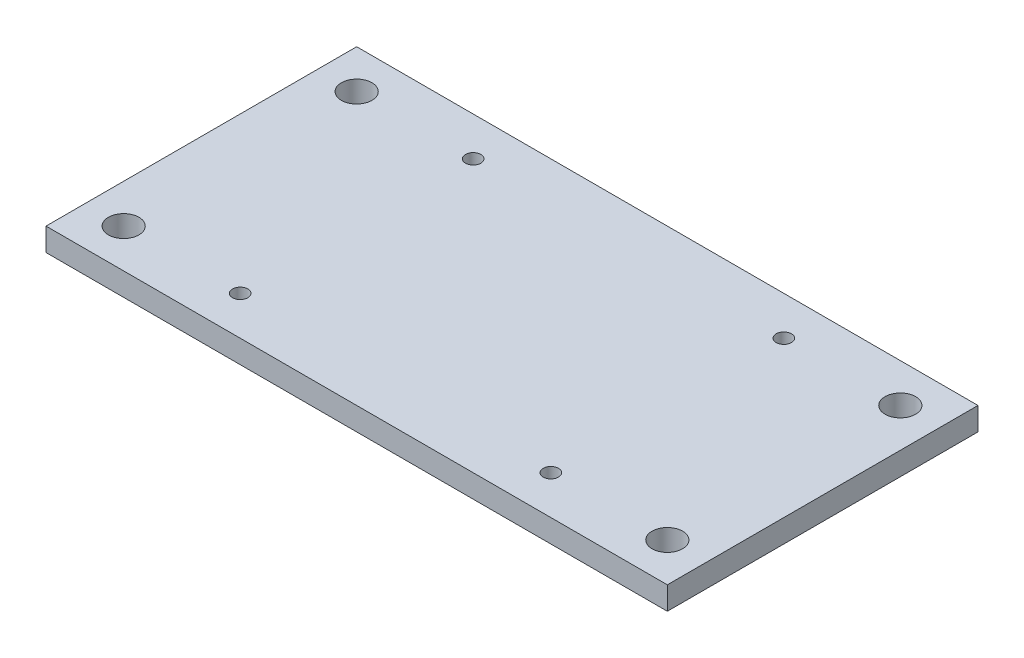
ISO-10303-21;
HEADER;
FILE_DESCRIPTION(('STEP AP214'),'2;1');
FILE_NAME('part.step','',(''),(''),'','','');
FILE_SCHEMA(('AUTOMOTIVE_DESIGN { 1 0 10303 214 1 1 1 1 }'));
ENDSEC;
DATA;
#1=APPLICATION_CONTEXT('core data for automotive mechanical design processes');
#2=APPLICATION_PROTOCOL_DEFINITION('international standard','automotive_design',2000,#1);
#3=PRODUCT_CONTEXT('',#1,'mechanical');
#4=PRODUCT('Part','Part','',(#3));
#5=PRODUCT_RELATED_PRODUCT_CATEGORY('part','',(#4));
#6=PRODUCT_DEFINITION_FORMATION('','',#4);
#7=PRODUCT_DEFINITION_CONTEXT('part definition',#1,'design');
#8=PRODUCT_DEFINITION('design','',#6,#7);
#9=PRODUCT_DEFINITION_SHAPE('','',#8);
#10=(LENGTH_UNIT() NAMED_UNIT(*) SI_UNIT(.MILLI.,.METRE.));
#11=(NAMED_UNIT(*) PLANE_ANGLE_UNIT() SI_UNIT($,.RADIAN.));
#12=(NAMED_UNIT(*) SI_UNIT($,.STERADIAN.) SOLID_ANGLE_UNIT());
#13=UNCERTAINTY_MEASURE_WITH_UNIT(LENGTH_MEASURE(1.E-05),#10,'distance_accuracy_value','');
#14=(GEOMETRIC_REPRESENTATION_CONTEXT(3) GLOBAL_UNCERTAINTY_ASSIGNED_CONTEXT((#13)) GLOBAL_UNIT_ASSIGNED_CONTEXT((#10,
#11,#12)) REPRESENTATION_CONTEXT('',''));
#15=CARTESIAN_POINT('',(0.,0.,0.));
#16=DIRECTION('',(0.,0.,1.));
#17=DIRECTION('',(1.,0.,0.));
#18=AXIS2_PLACEMENT_3D('',#15,#16,#17);
#19=CARTESIAN_POINT('',(0.,1.5,0.));
#20=DIRECTION('',(0.,-1.,0.));
#21=DIRECTION('',(0.,0.,-1.));
#22=AXIS2_PLACEMENT_3D('',#19,#20,#21);
#23=PLANE('',#22);
#24=CARTESIAN_POINT('',(30.48,1.5,-2.54));
#25=DIRECTION('',(0.,1.,0.));
#26=DIRECTION('',(0.,0.,-1.));
#27=AXIS2_PLACEMENT_3D('',#24,#25,#26);
#28=CIRCLE('',#27,0.499999999999999);
#29=CARTESIAN_POINT('',(30.48,1.5,-3.04));
#30=VERTEX_POINT('',#29);
#31=EDGE_CURVE('E145',#30,#30,#28,.T.);
#32=ORIENTED_EDGE('',*,*,#31,.F.);
#33=EDGE_LOOP('',(#32));
#34=FACE_BOUND('',#33,.T.);
#35=CARTESIAN_POINT('',(10.16,1.5,-2.54));
#36=DIRECTION('',(0.,1.,0.));
#37=DIRECTION('',(0.,0.,1.));
#38=AXIS2_PLACEMENT_3D('',#35,#36,#37);
#39=CIRCLE('',#38,0.499999999999999);
#40=CARTESIAN_POINT('',(10.16,1.5,-2.04));
#41=VERTEX_POINT('',#40);
#42=EDGE_CURVE('E133',#41,#41,#39,.T.);
#43=ORIENTED_EDGE('',*,*,#42,.F.);
#44=EDGE_LOOP('',(#43));
#45=FACE_BOUND('',#44,.T.);
#46=CARTESIAN_POINT('',(38.1,1.5,-17.78));
#47=DIRECTION('',(0.,1.,0.));
#48=DIRECTION('',(0.,0.,1.));
#49=AXIS2_PLACEMENT_3D('',#46,#47,#48);
#50=CIRCLE('',#49,0.999999999999991);
#51=CARTESIAN_POINT('',(38.1,1.5,-16.78));
#52=VERTEX_POINT('',#51);
#53=EDGE_CURVE('E121',#52,#52,#50,.T.);
#54=ORIENTED_EDGE('',*,*,#53,.F.);
#55=EDGE_LOOP('',(#54));
#56=FACE_BOUND('',#55,.T.);
#57=CARTESIAN_POINT('',(2.54,1.5,-2.54));
#58=DIRECTION('',(0.,1.,0.));
#59=DIRECTION('',(0.,0.,1.));
#60=AXIS2_PLACEMENT_3D('',#57,#58,#59);
#61=CIRCLE('',#60,1.);
#62=CARTESIAN_POINT('',(2.54,1.5,-1.54));
#63=VERTEX_POINT('',#62);
#64=EDGE_CURVE('E100',#63,#63,#61,.T.);
#65=ORIENTED_EDGE('',*,*,#64,.F.);
#66=EDGE_LOOP('',(#65));
#67=FACE_BOUND('',#66,.T.);
#68=DIRECTION('',(0.,0.,1.));
#69=VECTOR('',#68,1.);
#70=CARTESIAN_POINT('',(0.,1.5,0.));
#71=LINE('',#70,#69);
#72=CARTESIAN_POINT('',(0.,1.5,-20.32));
#73=VERTEX_POINT('',#72);
#74=CARTESIAN_POINT('',(0.,1.5,0.));
#75=VERTEX_POINT('',#74);
#76=EDGE_CURVE('E85',#73,#75,#71,.T.);
#77=ORIENTED_EDGE('',*,*,#76,.T.);
#78=DIRECTION('',(1.,0.,0.));
#79=VECTOR('',#78,1.);
#80=CARTESIAN_POINT('',(0.,1.5,0.));
#81=LINE('',#80,#79);
#82=CARTESIAN_POINT('',(40.64,1.5,0.));
#83=VERTEX_POINT('',#82);
#84=EDGE_CURVE('E80',#75,#83,#81,.T.);
#85=ORIENTED_EDGE('',*,*,#84,.T.);
#86=DIRECTION('',(0.,0.,-1.));
#87=VECTOR('',#86,1.);
#88=CARTESIAN_POINT('',(40.64,1.5,0.));
#89=LINE('',#88,#87);
#90=CARTESIAN_POINT('',(40.64,1.5,-20.32));
#91=VERTEX_POINT('',#90);
#92=EDGE_CURVE('E83',#83,#91,#89,.T.);
#93=ORIENTED_EDGE('',*,*,#92,.T.);
#94=DIRECTION('',(-1.,0.,0.));
#95=VECTOR('',#94,1.);
#96=CARTESIAN_POINT('',(0.,1.5,-20.32));
#97=LINE('',#96,#95);
#98=EDGE_CURVE('E50',#91,#73,#97,.T.);
#99=ORIENTED_EDGE('',*,*,#98,.T.);
#100=EDGE_LOOP('',(#77,#85,#93,#99));
#101=FACE_BOUND('',#100,.T.);
#102=CARTESIAN_POINT('',(38.1,1.5,-2.54));
#103=DIRECTION('',(0.,1.,0.));
#104=DIRECTION('',(0.,0.,-1.));
#105=AXIS2_PLACEMENT_3D('',#102,#103,#104);
#106=CIRCLE('',#105,0.999999999999998);
#107=CARTESIAN_POINT('',(38.1,1.5,-3.54));
#108=VERTEX_POINT('',#107);
#109=EDGE_CURVE('E115',#108,#108,#106,.T.);
#110=ORIENTED_EDGE('',*,*,#109,.F.);
#111=EDGE_LOOP('',(#110));
#112=FACE_BOUND('',#111,.T.);
#113=CARTESIAN_POINT('',(2.54,1.5,-17.78));
#114=DIRECTION('',(0.,1.,0.));
#115=DIRECTION('',(0.,0.,-1.));
#116=AXIS2_PLACEMENT_3D('',#113,#114,#115);
#117=CIRCLE('',#116,0.999999999999999);
#118=CARTESIAN_POINT('',(2.54,1.5,-18.78));
#119=VERTEX_POINT('',#118);
#120=EDGE_CURVE('E127',#119,#119,#117,.T.);
#121=ORIENTED_EDGE('',*,*,#120,.F.);
#122=EDGE_LOOP('',(#121));
#123=FACE_BOUND('',#122,.T.);
#124=CARTESIAN_POINT('',(10.16,1.5,-17.78));
#125=DIRECTION('',(0.,1.,0.));
#126=DIRECTION('',(0.,0.,-1.));
#127=AXIS2_PLACEMENT_3D('',#124,#125,#126);
#128=CIRCLE('',#127,0.499999999999999);
#129=CARTESIAN_POINT('',(10.16,1.5,-18.28));
#130=VERTEX_POINT('',#129);
#131=EDGE_CURVE('E139',#130,#130,#128,.T.);
#132=ORIENTED_EDGE('',*,*,#131,.F.);
#133=EDGE_LOOP('',(#132));
#134=FACE_BOUND('',#133,.T.);
#135=CARTESIAN_POINT('',(30.48,1.5,-17.78));
#136=DIRECTION('',(0.,1.,0.));
#137=DIRECTION('',(0.,0.,1.));
#138=AXIS2_PLACEMENT_3D('',#135,#136,#137);
#139=CIRCLE('',#138,0.499999999999999);
#140=CARTESIAN_POINT('',(30.48,1.5,-17.28));
#141=VERTEX_POINT('',#140);
#142=EDGE_CURVE('E151',#141,#141,#139,.T.);
#143=ORIENTED_EDGE('',*,*,#142,.F.);
#144=EDGE_LOOP('',(#143));
#145=FACE_BOUND('',#144,.T.);
#146=ADVANCED_FACE('F33',(#34,#45,#56,#67,#101,#112,#123,#134,#145),#23,.F.);
#147=CARTESIAN_POINT('',(0.,0.,0.));
#148=DIRECTION('',(0.,-1.,0.));
#149=DIRECTION('',(0.,0.,-1.));
#150=AXIS2_PLACEMENT_3D('',#147,#148,#149);
#151=PLANE('',#150);
#152=CARTESIAN_POINT('',(30.48,0.,-2.54));
#153=DIRECTION('',(0.,1.,0.));
#154=DIRECTION('',(0.,0.,-1.));
#155=AXIS2_PLACEMENT_3D('',#152,#153,#154);
#156=CIRCLE('',#155,0.499999999999999);
#157=CARTESIAN_POINT('',(30.48,0.,-3.04));
#158=VERTEX_POINT('',#157);
#159=EDGE_CURVE('E148',#158,#158,#156,.T.);
#160=ORIENTED_EDGE('',*,*,#159,.T.);
#161=EDGE_LOOP('',(#160));
#162=FACE_BOUND('',#161,.T.);
#163=CARTESIAN_POINT('',(10.16,0.,-2.54));
#164=DIRECTION('',(0.,1.,0.));
#165=DIRECTION('',(0.,0.,1.));
#166=AXIS2_PLACEMENT_3D('',#163,#164,#165);
#167=CIRCLE('',#166,0.499999999999999);
#168=CARTESIAN_POINT('',(10.16,0.,-2.04));
#169=VERTEX_POINT('',#168);
#170=EDGE_CURVE('E136',#169,#169,#167,.T.);
#171=ORIENTED_EDGE('',*,*,#170,.T.);
#172=EDGE_LOOP('',(#171));
#173=FACE_BOUND('',#172,.T.);
#174=CARTESIAN_POINT('',(38.1,0.,-17.78));
#175=DIRECTION('',(0.,1.,0.));
#176=DIRECTION('',(0.,0.,1.));
#177=AXIS2_PLACEMENT_3D('',#174,#175,#176);
#178=CIRCLE('',#177,0.999999999999991);
#179=CARTESIAN_POINT('',(38.1,0.,-16.78));
#180=VERTEX_POINT('',#179);
#181=EDGE_CURVE('E124',#180,#180,#178,.T.);
#182=ORIENTED_EDGE('',*,*,#181,.T.);
#183=EDGE_LOOP('',(#182));
#184=FACE_BOUND('',#183,.T.);
#185=CARTESIAN_POINT('',(2.54,0.,-2.54));
#186=DIRECTION('',(0.,1.,0.));
#187=DIRECTION('',(0.,0.,1.));
#188=AXIS2_PLACEMENT_3D('',#185,#186,#187);
#189=CIRCLE('',#188,1.);
#190=CARTESIAN_POINT('',(2.54,0.,-1.54));
#191=VERTEX_POINT('',#190);
#192=EDGE_CURVE('E112',#191,#191,#189,.T.);
#193=ORIENTED_EDGE('',*,*,#192,.T.);
#194=EDGE_LOOP('',(#193));
#195=FACE_BOUND('',#194,.T.);
#196=DIRECTION('',(0.,0.,1.));
#197=VECTOR('',#196,1.);
#198=CARTESIAN_POINT('',(0.,0.,0.));
#199=LINE('',#198,#197);
#200=CARTESIAN_POINT('',(0.,0.,-20.32));
#201=VERTEX_POINT('',#200);
#202=CARTESIAN_POINT('',(0.,0.,0.));
#203=VERTEX_POINT('',#202);
#204=EDGE_CURVE('E97',#201,#203,#199,.T.);
#205=ORIENTED_EDGE('',*,*,#204,.F.);
#206=DIRECTION('',(-1.,0.,0.));
#207=VECTOR('',#206,1.);
#208=CARTESIAN_POINT('',(0.,0.,-20.32));
#209=LINE('',#208,#207);
#210=CARTESIAN_POINT('',(40.64,0.,-20.32));
#211=VERTEX_POINT('',#210);
#212=EDGE_CURVE('E73',#211,#201,#209,.T.);
#213=ORIENTED_EDGE('',*,*,#212,.F.);
#214=DIRECTION('',(0.,0.,-1.));
#215=VECTOR('',#214,1.);
#216=CARTESIAN_POINT('',(40.64,0.,0.));
#217=LINE('',#216,#215);
#218=CARTESIAN_POINT('',(40.64,0.,0.));
#219=VERTEX_POINT('',#218);
#220=EDGE_CURVE('E67',#219,#211,#217,.T.);
#221=ORIENTED_EDGE('',*,*,#220,.F.);
#222=DIRECTION('',(1.,0.,0.));
#223=VECTOR('',#222,1.);
#224=CARTESIAN_POINT('',(0.,0.,0.));
#225=LINE('',#224,#223);
#226=EDGE_CURVE('E89',#203,#219,#225,.T.);
#227=ORIENTED_EDGE('',*,*,#226,.F.);
#228=EDGE_LOOP('',(#205,#213,#221,#227));
#229=FACE_BOUND('',#228,.T.);
#230=CARTESIAN_POINT('',(38.1,0.,-2.54));
#231=DIRECTION('',(0.,1.,0.));
#232=DIRECTION('',(0.,0.,-1.));
#233=AXIS2_PLACEMENT_3D('',#230,#231,#232);
#234=CIRCLE('',#233,0.999999999999998);
#235=CARTESIAN_POINT('',(38.1,0.,-3.54));
#236=VERTEX_POINT('',#235);
#237=EDGE_CURVE('E118',#236,#236,#234,.T.);
#238=ORIENTED_EDGE('',*,*,#237,.T.);
#239=EDGE_LOOP('',(#238));
#240=FACE_BOUND('',#239,.T.);
#241=CARTESIAN_POINT('',(2.54,0.,-17.78));
#242=DIRECTION('',(0.,1.,0.));
#243=DIRECTION('',(0.,0.,-1.));
#244=AXIS2_PLACEMENT_3D('',#241,#242,#243);
#245=CIRCLE('',#244,0.999999999999999);
#246=CARTESIAN_POINT('',(2.54,0.,-18.78));
#247=VERTEX_POINT('',#246);
#248=EDGE_CURVE('E130',#247,#247,#245,.T.);
#249=ORIENTED_EDGE('',*,*,#248,.T.);
#250=EDGE_LOOP('',(#249));
#251=FACE_BOUND('',#250,.T.);
#252=CARTESIAN_POINT('',(10.16,0.,-17.78));
#253=DIRECTION('',(0.,1.,0.));
#254=DIRECTION('',(0.,0.,-1.));
#255=AXIS2_PLACEMENT_3D('',#252,#253,#254);
#256=CIRCLE('',#255,0.499999999999999);
#257=CARTESIAN_POINT('',(10.16,0.,-18.28));
#258=VERTEX_POINT('',#257);
#259=EDGE_CURVE('E142',#258,#258,#256,.T.);
#260=ORIENTED_EDGE('',*,*,#259,.T.);
#261=EDGE_LOOP('',(#260));
#262=FACE_BOUND('',#261,.T.);
#263=CARTESIAN_POINT('',(30.48,0.,-17.78));
#264=DIRECTION('',(0.,1.,0.));
#265=DIRECTION('',(0.,0.,1.));
#266=AXIS2_PLACEMENT_3D('',#263,#264,#265);
#267=CIRCLE('',#266,0.499999999999999);
#268=CARTESIAN_POINT('',(30.48,0.,-17.28));
#269=VERTEX_POINT('',#268);
#270=EDGE_CURVE('E154',#269,#269,#267,.T.);
#271=ORIENTED_EDGE('',*,*,#270,.T.);
#272=EDGE_LOOP('',(#271));
#273=FACE_BOUND('',#272,.T.);
#274=ADVANCED_FACE('F108',(#162,#173,#184,#195,#229,#240,#251,#262,#273),#151,.T.);
#275=CARTESIAN_POINT('',(0.,1.5,0.));
#276=DIRECTION('',(1.,0.,0.));
#277=DIRECTION('',(0.,0.,-1.));
#278=AXIS2_PLACEMENT_3D('',#275,#276,#277);
#279=PLANE('',#278);
#280=ORIENTED_EDGE('',*,*,#204,.T.);
#281=DIRECTION('',(0.,-1.,0.));
#282=VECTOR('',#281,1.);
#283=CARTESIAN_POINT('',(0.,1.5,0.));
#284=LINE('',#283,#282);
#285=EDGE_CURVE('E11',#75,#203,#284,.T.);
#286=ORIENTED_EDGE('',*,*,#285,.F.);
#287=ORIENTED_EDGE('',*,*,#76,.F.);
#288=DIRECTION('',(0.,-1.,0.));
#289=VECTOR('',#288,1.);
#290=CARTESIAN_POINT('',(0.,1.5,-20.32));
#291=LINE('',#290,#289);
#292=EDGE_CURVE('E93',#73,#201,#291,.T.);
#293=ORIENTED_EDGE('',*,*,#292,.T.);
#294=EDGE_LOOP('',(#280,#286,#287,#293));
#295=FACE_BOUND('',#294,.T.);
#296=ADVANCED_FACE('F35',(#295),#279,.F.);
#297=CARTESIAN_POINT('',(0.,1.5,0.));
#298=DIRECTION('',(0.,0.,-1.));
#299=DIRECTION('',(-1.,0.,0.));
#300=AXIS2_PLACEMENT_3D('',#297,#298,#299);
#301=PLANE('',#300);
#302=ORIENTED_EDGE('',*,*,#226,.T.);
#303=DIRECTION('',(0.,-1.,0.));
#304=VECTOR('',#303,1.);
#305=CARTESIAN_POINT('',(40.64,1.5,0.));
#306=LINE('',#305,#304);
#307=EDGE_CURVE('E42',#83,#219,#306,.T.);
#308=ORIENTED_EDGE('',*,*,#307,.F.);
#309=ORIENTED_EDGE('',*,*,#84,.F.);
#310=ORIENTED_EDGE('',*,*,#285,.T.);
#311=EDGE_LOOP('',(#302,#308,#309,#310));
#312=FACE_BOUND('',#311,.T.);
#313=ADVANCED_FACE('F88',(#312),#301,.F.);
#314=CARTESIAN_POINT('',(40.64,1.5,0.));
#315=DIRECTION('',(-1.,0.,0.));
#316=DIRECTION('',(0.,0.,1.));
#317=AXIS2_PLACEMENT_3D('',#314,#315,#316);
#318=PLANE('',#317);
#319=ORIENTED_EDGE('',*,*,#220,.T.);
#320=DIRECTION('',(0.,-1.,0.));
#321=VECTOR('',#320,1.);
#322=CARTESIAN_POINT('',(40.64,1.5,-20.32));
#323=LINE('',#322,#321);
#324=EDGE_CURVE('E90',#91,#211,#323,.T.);
#325=ORIENTED_EDGE('',*,*,#324,.F.);
#326=ORIENTED_EDGE('',*,*,#92,.F.);
#327=ORIENTED_EDGE('',*,*,#307,.T.);
#328=EDGE_LOOP('',(#319,#325,#326,#327));
#329=FACE_BOUND('',#328,.T.);
#330=ADVANCED_FACE('F91',(#329),#318,.F.);
#331=CARTESIAN_POINT('',(0.,1.5,-20.32));
#332=DIRECTION('',(0.,0.,1.));
#333=DIRECTION('',(1.,0.,0.));
#334=AXIS2_PLACEMENT_3D('',#331,#332,#333);
#335=PLANE('',#334);
#336=ORIENTED_EDGE('',*,*,#212,.T.);
#337=ORIENTED_EDGE('',*,*,#292,.F.);
#338=ORIENTED_EDGE('',*,*,#98,.F.);
#339=ORIENTED_EDGE('',*,*,#324,.T.);
#340=EDGE_LOOP('',(#336,#337,#338,#339));
#341=FACE_BOUND('',#340,.T.);
#342=ADVANCED_FACE('F105',(#341),#335,.F.);
#343=CARTESIAN_POINT('',(2.54,1.5,-2.54));
#344=DIRECTION('',(0.,-1.,0.));
#345=DIRECTION('',(0.,0.,-1.));
#346=AXIS2_PLACEMENT_3D('',#343,#344,#345);
#347=CYLINDRICAL_SURFACE('',#346,1.);
#348=ORIENTED_EDGE('',*,*,#64,.T.);
#349=EDGE_LOOP('',(#348));
#350=FACE_BOUND('',#349,.T.);
#351=ORIENTED_EDGE('',*,*,#192,.F.);
#352=EDGE_LOOP('',(#351));
#353=FACE_BOUND('',#352,.T.);
#354=ADVANCED_FACE('F174',(#350,#353),#347,.F.);
#355=CARTESIAN_POINT('',(38.1,1.5,-2.54));
#356=DIRECTION('',(0.,-1.,0.));
#357=DIRECTION('',(0.,0.,-1.));
#358=AXIS2_PLACEMENT_3D('',#355,#356,#357);
#359=CYLINDRICAL_SURFACE('',#358,0.999999999999998);
#360=ORIENTED_EDGE('',*,*,#109,.T.);
#361=EDGE_LOOP('',(#360));
#362=FACE_BOUND('',#361,.T.);
#363=ORIENTED_EDGE('',*,*,#237,.F.);
#364=EDGE_LOOP('',(#363));
#365=FACE_BOUND('',#364,.T.);
#366=ADVANCED_FACE('F220',(#362,#365),#359,.F.);
#367=CARTESIAN_POINT('',(38.1,1.5,-17.78));
#368=DIRECTION('',(0.,-1.,0.));
#369=DIRECTION('',(0.,0.,-1.));
#370=AXIS2_PLACEMENT_3D('',#367,#368,#369);
#371=CYLINDRICAL_SURFACE('',#370,0.999999999999991);
#372=ORIENTED_EDGE('',*,*,#53,.T.);
#373=EDGE_LOOP('',(#372));
#374=FACE_BOUND('',#373,.T.);
#375=ORIENTED_EDGE('',*,*,#181,.F.);
#376=EDGE_LOOP('',(#375));
#377=FACE_BOUND('',#376,.T.);
#378=ADVANCED_FACE('F228',(#374,#377),#371,.F.);
#379=CARTESIAN_POINT('',(2.54,1.5,-17.78));
#380=DIRECTION('',(0.,-1.,0.));
#381=DIRECTION('',(0.,0.,-1.));
#382=AXIS2_PLACEMENT_3D('',#379,#380,#381);
#383=CYLINDRICAL_SURFACE('',#382,0.999999999999999);
#384=ORIENTED_EDGE('',*,*,#120,.T.);
#385=EDGE_LOOP('',(#384));
#386=FACE_BOUND('',#385,.T.);
#387=ORIENTED_EDGE('',*,*,#248,.F.);
#388=EDGE_LOOP('',(#387));
#389=FACE_BOUND('',#388,.T.);
#390=ADVANCED_FACE('F236',(#386,#389),#383,.F.);
#391=CARTESIAN_POINT('',(10.16,1.5,-2.54));
#392=DIRECTION('',(0.,-1.,0.));
#393=DIRECTION('',(0.,0.,-1.));
#394=AXIS2_PLACEMENT_3D('',#391,#392,#393);
#395=CYLINDRICAL_SURFACE('',#394,0.499999999999999);
#396=ORIENTED_EDGE('',*,*,#42,.T.);
#397=EDGE_LOOP('',(#396));
#398=FACE_BOUND('',#397,.T.);
#399=ORIENTED_EDGE('',*,*,#170,.F.);
#400=EDGE_LOOP('',(#399));
#401=FACE_BOUND('',#400,.T.);
#402=ADVANCED_FACE('F245',(#398,#401),#395,.F.);
#403=CARTESIAN_POINT('',(10.16,1.5,-17.78));
#404=DIRECTION('',(0.,-1.,0.));
#405=DIRECTION('',(0.,0.,-1.));
#406=AXIS2_PLACEMENT_3D('',#403,#404,#405);
#407=CYLINDRICAL_SURFACE('',#406,0.499999999999999);
#408=ORIENTED_EDGE('',*,*,#131,.T.);
#409=EDGE_LOOP('',(#408));
#410=FACE_BOUND('',#409,.T.);
#411=ORIENTED_EDGE('',*,*,#259,.F.);
#412=EDGE_LOOP('',(#411));
#413=FACE_BOUND('',#412,.T.);
#414=ADVANCED_FACE('F254',(#410,#413),#407,.F.);
#415=CARTESIAN_POINT('',(30.48,1.5,-2.54));
#416=DIRECTION('',(0.,-1.,0.));
#417=DIRECTION('',(0.,0.,-1.));
#418=AXIS2_PLACEMENT_3D('',#415,#416,#417);
#419=CYLINDRICAL_SURFACE('',#418,0.499999999999999);
#420=ORIENTED_EDGE('',*,*,#31,.T.);
#421=EDGE_LOOP('',(#420));
#422=FACE_BOUND('',#421,.T.);
#423=ORIENTED_EDGE('',*,*,#159,.F.);
#424=EDGE_LOOP('',(#423));
#425=FACE_BOUND('',#424,.T.);
#426=ADVANCED_FACE('F263',(#422,#425),#419,.F.);
#427=CARTESIAN_POINT('',(30.48,1.5,-17.78));
#428=DIRECTION('',(0.,-1.,0.));
#429=DIRECTION('',(0.,0.,-1.));
#430=AXIS2_PLACEMENT_3D('',#427,#428,#429);
#431=CYLINDRICAL_SURFACE('',#430,0.499999999999999);
#432=ORIENTED_EDGE('',*,*,#142,.T.);
#433=EDGE_LOOP('',(#432));
#434=FACE_BOUND('',#433,.T.);
#435=ORIENTED_EDGE('',*,*,#270,.F.);
#436=EDGE_LOOP('',(#435));
#437=FACE_BOUND('',#436,.T.);
#438=ADVANCED_FACE('F160',(#434,#437),#431,.F.);
#439=CLOSED_SHELL('',(#146,#274,#296,#313,#330,#342,#354,#366,#378,#390,#402,#414,#426,#438));
#440=MANIFOLD_SOLID_BREP('B2',#439);
#441=ADVANCED_BREP_SHAPE_REPRESENTATION('',(#18,#440),#14);
#442=SHAPE_DEFINITION_REPRESENTATION(#9,#441);
ENDSEC;
END-ISO-10303-21;
